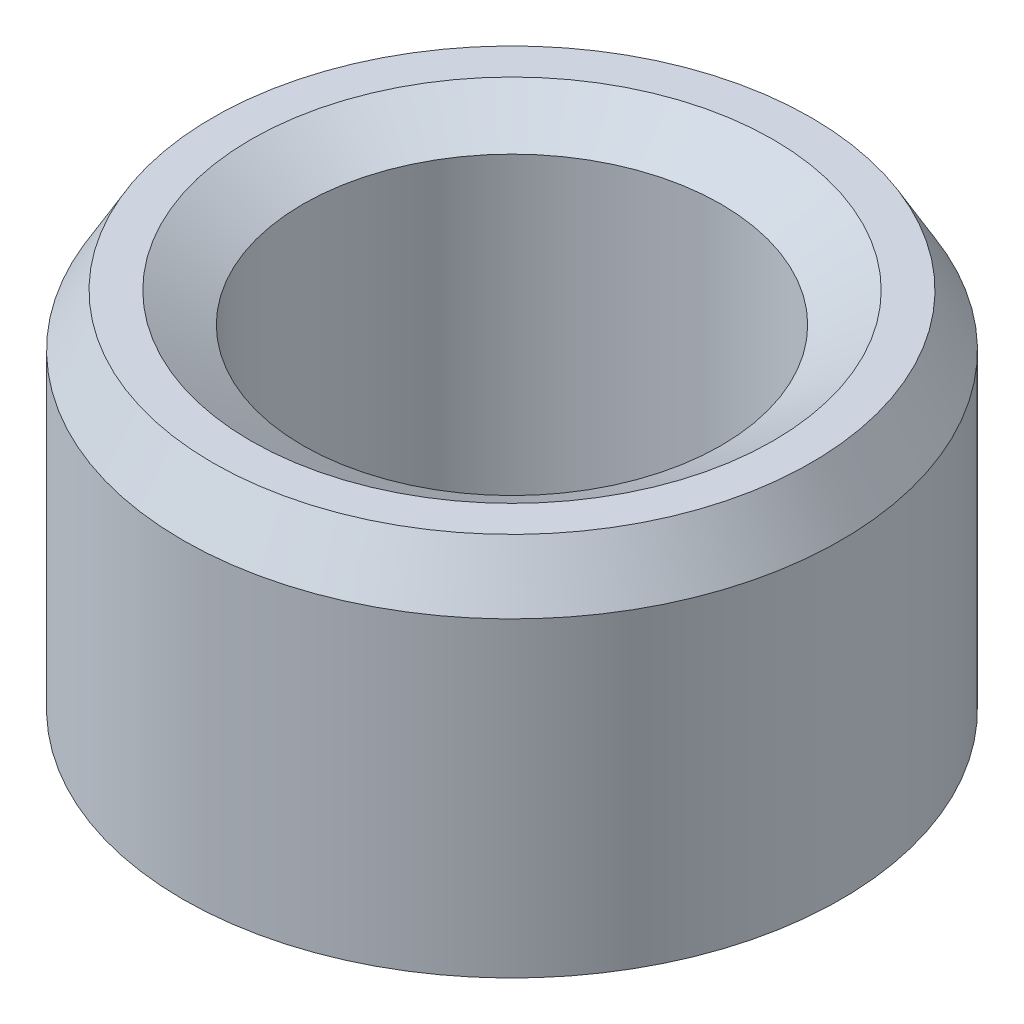
ISO-10303-21;
HEADER;
FILE_DESCRIPTION(('STEP AP214'),'2;1');
FILE_NAME('part.step','',(''),(''),'','','');
FILE_SCHEMA(('AUTOMOTIVE_DESIGN { 1 0 10303 214 1 1 1 1 }'));
ENDSEC;
DATA;
#1=APPLICATION_CONTEXT('core data for automotive mechanical design processes');
#2=APPLICATION_PROTOCOL_DEFINITION('international standard','automotive_design',2000,#1);
#3=PRODUCT_CONTEXT('',#1,'mechanical');
#4=PRODUCT('Part','Part','',(#3));
#5=PRODUCT_RELATED_PRODUCT_CATEGORY('part','',(#4));
#6=PRODUCT_DEFINITION_FORMATION('','',#4);
#7=PRODUCT_DEFINITION_CONTEXT('part definition',#1,'design');
#8=PRODUCT_DEFINITION('design','',#6,#7);
#9=PRODUCT_DEFINITION_SHAPE('','',#8);
#10=(LENGTH_UNIT() NAMED_UNIT(*) SI_UNIT(.MILLI.,.METRE.));
#11=(NAMED_UNIT(*) PLANE_ANGLE_UNIT() SI_UNIT($,.RADIAN.));
#12=(NAMED_UNIT(*) SI_UNIT($,.STERADIAN.) SOLID_ANGLE_UNIT());
#13=UNCERTAINTY_MEASURE_WITH_UNIT(LENGTH_MEASURE(1.E-05),#10,'distance_accuracy_value','');
#14=(GEOMETRIC_REPRESENTATION_CONTEXT(3) GLOBAL_UNCERTAINTY_ASSIGNED_CONTEXT((#13)) GLOBAL_UNIT_ASSIGNED_CONTEXT((#10,
#11,#12)) REPRESENTATION_CONTEXT('',''));
#15=CARTESIAN_POINT('',(0.,0.,0.));
#16=DIRECTION('',(0.,0.,1.));
#17=DIRECTION('',(1.,0.,0.));
#18=AXIS2_PLACEMENT_3D('',#15,#16,#17);
#19=CARTESIAN_POINT('',(0.,20.8946732584259,0.));
#20=DIRECTION('',(0.,-1.,0.));
#21=DIRECTION('',(0.,0.,-1.));
#22=AXIS2_PLACEMENT_3D('',#19,#20,#21);
#23=CYLINDRICAL_SURFACE('',#22,17.5);
#24=CARTESIAN_POINT('',(0.,1.59598908697006,0.));
#25=DIRECTION('',(0.,1.,0.));
#26=DIRECTION('',(0.,0.,1.));
#27=AXIS2_PLACEMENT_3D('',#24,#25,#26);
#28=CIRCLE('',#27,17.5);
#29=CARTESIAN_POINT('',(0.,1.59598908697006,-17.5));
#30=VERTEX_POINT('',#29);
#31=EDGE_CURVE('E10',#30,#30,#28,.T.);
#32=CARTESIAN_POINT('',(0.,18.1303390714683,0.));
#33=DIRECTION('',(0.,1.,0.));
#34=DIRECTION('',(0.,0.,1.));
#35=AXIS2_PLACEMENT_3D('',#32,#33,#34);
#36=CIRCLE('',#35,17.5);
#37=CARTESIAN_POINT('',(0.,18.1303390714683,-17.5));
#38=VERTEX_POINT('',#37);
#39=EDGE_CURVE('E50',#38,#38,#36,.F.);
#40=CARTESIAN_POINT('',(0.,1.59598908697006,-17.5));
#41=CARTESIAN_POINT('',(0.,1.76822189930859,-17.5));
#42=CARTESIAN_POINT('',(0.,1.94045471164711,-17.5));
#43=CARTESIAN_POINT('',(0.,2.28492033632416,-17.5));
#44=CARTESIAN_POINT('',(0.,2.45715314866268,-17.5));
#45=CARTESIAN_POINT('',(0.,2.80161877333973,-17.5));
#46=CARTESIAN_POINT('',(0.,2.97385158567825,-17.5));
#47=CARTESIAN_POINT('',(0.,3.3183172103553,-17.5));
#48=CARTESIAN_POINT('',(0.,3.49055002269382,-17.5));
#49=CARTESIAN_POINT('',(0.,3.83501564737087,-17.5));
#50=CARTESIAN_POINT('',(0.,4.00724845970939,-17.5));
#51=CARTESIAN_POINT('',(0.,4.35171408438644,-17.5));
#52=CARTESIAN_POINT('',(0.,4.52394689672497,-17.5));
#53=CARTESIAN_POINT('',(0.,4.86841252140201,-17.5));
#54=CARTESIAN_POINT('',(0.,5.04064533374054,-17.5));
#55=CARTESIAN_POINT('',(0.,5.38511095841759,-17.5));
#56=CARTESIAN_POINT('',(0.,5.55734377075611,-17.5));
#57=CARTESIAN_POINT('',(0.,5.90180939543315,-17.5));
#58=CARTESIAN_POINT('',(0.,6.07404220777168,-17.5));
#59=CARTESIAN_POINT('',(0.,6.41850783244873,-17.5));
#60=CARTESIAN_POINT('',(0.,6.59074064478725,-17.5));
#61=CARTESIAN_POINT('',(0.,6.9352062694643,-17.5));
#62=CARTESIAN_POINT('',(0.,7.10743908180282,-17.5));
#63=CARTESIAN_POINT('',(0.,7.45190470647987,-17.5));
#64=CARTESIAN_POINT('',(0.,7.62413751881839,-17.5));
#65=CARTESIAN_POINT('',(0.,7.96860314349544,-17.5));
#66=CARTESIAN_POINT('',(0.,8.14083595583396,-17.5));
#67=CARTESIAN_POINT('',(0.,8.48530158051101,-17.5));
#68=CARTESIAN_POINT('',(0.,8.65753439284954,-17.5));
#69=CARTESIAN_POINT('',(0.,9.00200001752658,-17.5));
#70=CARTESIAN_POINT('',(0.,9.17423282986511,-17.5));
#71=CARTESIAN_POINT('',(0.,9.51869845454216,-17.5));
#72=CARTESIAN_POINT('',(0.,9.69093126688068,-17.5));
#73=CARTESIAN_POINT('',(0.,10.0353968915577,-17.5));
#74=CARTESIAN_POINT('',(0.,10.2076297038963,-17.5));
#75=CARTESIAN_POINT('',(0.,10.5520953285733,-17.5));
#76=CARTESIAN_POINT('',(0.,10.7243281409118,-17.5));
#77=CARTESIAN_POINT('',(0.,11.0687937655889,-17.5));
#78=CARTESIAN_POINT('',(0.,11.2410265779274,-17.5));
#79=CARTESIAN_POINT('',(0.,11.5854922026044,-17.5));
#80=CARTESIAN_POINT('',(0.,11.757725014943,-17.5));
#81=CARTESIAN_POINT('',(0.,12.10219063962,-17.5));
#82=CARTESIAN_POINT('',(0.,12.2744234519585,-17.5));
#83=CARTESIAN_POINT('',(0.,12.6188890766356,-17.5));
#84=CARTESIAN_POINT('',(0.,12.7911218889741,-17.5));
#85=CARTESIAN_POINT('',(0.,13.1355875136512,-17.5));
#86=CARTESIAN_POINT('',(0.,13.3078203259897,-17.5));
#87=CARTESIAN_POINT('',(0.,13.6522859506667,-17.5));
#88=CARTESIAN_POINT('',(0.,13.8245187630052,-17.5));
#89=CARTESIAN_POINT('',(0.,14.1689843876823,-17.5));
#90=CARTESIAN_POINT('',(0.,14.3412172000208,-17.5));
#91=CARTESIAN_POINT('',(0.,14.6856828246979,-17.5));
#92=CARTESIAN_POINT('',(0.,14.8579156370364,-17.5));
#93=CARTESIAN_POINT('',(0.,15.2023812617134,-17.5));
#94=CARTESIAN_POINT('',(0.,15.374614074052,-17.5));
#95=CARTESIAN_POINT('',(0.,15.719079698729,-17.5));
#96=CARTESIAN_POINT('',(0.,15.8913125110675,-17.5));
#97=CARTESIAN_POINT('',(0.,16.2357781357446,-17.5));
#98=CARTESIAN_POINT('',(0.,16.4080109480831,-17.5));
#99=CARTESIAN_POINT('',(0.,16.7524765727602,-17.5));
#100=CARTESIAN_POINT('',(0.,16.9247093850987,-17.5));
#101=CARTESIAN_POINT('',(0.,17.2691750097757,-17.5));
#102=CARTESIAN_POINT('',(0.,17.4414078221142,-17.5));
#103=CARTESIAN_POINT('',(0.,17.7858734467913,-17.5));
#104=CARTESIAN_POINT('',(0.,17.9581062591298,-17.5));
#105=CARTESIAN_POINT('',(0.,18.1303390714683,-17.5));
#106=B_SPLINE_CURVE_WITH_KNOTS('',3,(#40,#41,#42,#43,#44,#45,#46,#47,#48,#49,#50,#51,#52,#53,
#54,#55,#56,#57,#58,#59,#60,#61,#62,#63,#64,#65,#66,#67,#68,#69,#70,#71,#72,#73,#74,#75,#76,#77,
#78,#79,#80,#81,#82,#83,#84,#85,#86,#87,#88,#89,#90,#91,#92,#93,#94,#95,#96,#97,#98,#99,#100,
#101,#102,#103,#104,#105),.UNSPECIFIED.,.F.,.F.,(4,2,2,2,2,2,2,2,2,2,2,2,2,2,2,2,2,2,2,2,2,2,2,
2,2,2,2,2,2,2,2,2,4),(0.,0.516698437015572,1.03339687403114,1.55009531104671,2.06679374806229,
2.58349218507786,3.10019062209343,3.616889059109,4.13358749612457,4.65028593314014,
5.16698437015571,5.68368280717128,6.20038124418685,6.71707968120243,7.233778118218,
7.75047655523357,8.26717499224914,8.78387342926471,9.30057186628028,9.81727030329585,
10.3339687403114,10.850667177327,11.3673656143426,11.8840640513581,12.4007624883737,
12.9174609253893,13.4341593624049,13.9508577994204,14.467556236436,14.9842546734516,
15.5009531104671,16.0176515474827,16.5343499844983),.UNSPECIFIED.);
#107=EDGE_CURVE('BSEAM39',#30,#38,#106,.T.);
#108=ORIENTED_EDGE('',*,*,#31,.T.);
#109=ORIENTED_EDGE('',*,*,#39,.T.);
#110=ORIENTED_EDGE('',*,*,#107,.T.);
#111=ORIENTED_EDGE('',*,*,#107,.F.);
#112=EDGE_LOOP('',(#108,#110,#109,#111));
#113=FACE_BOUND('',#112,.T.);
#114=ADVANCED_FACE('F39',(#113),#23,.T.);
#115=CARTESIAN_POINT('',(0.,20.8946732584259,0.));
#116=DIRECTION('',(0.,1.,0.));
#117=DIRECTION('',(0.,0.,1.));
#118=AXIS2_PLACEMENT_3D('',#115,#116,#117);
#119=PLANE('',#118);
#120=CARTESIAN_POINT('',(0.,20.8946732584259,0.));
#121=DIRECTION('',(0.,1.,0.));
#122=DIRECTION('',(0.,0.,1.));
#123=AXIS2_PLACEMENT_3D('',#120,#121,#122);
#124=CIRCLE('',#123,13.8821055287034);
#125=CARTESIAN_POINT('',(0.,20.8946732584259,13.8821055287034));
#126=VERTEX_POINT('',#125);
#127=EDGE_CURVE('E58',#126,#126,#124,.F.);
#128=ORIENTED_EDGE('',*,*,#127,.T.);
#129=EDGE_LOOP('',(#128));
#130=FACE_BOUND('',#129,.T.);
#131=CARTESIAN_POINT('',(0.,20.8946732584259,0.));
#132=DIRECTION('',(0.,1.,0.));
#133=DIRECTION('',(0.,0.,1.));
#134=AXIS2_PLACEMENT_3D('',#131,#132,#133);
#135=CIRCLE('',#134,15.90401091303);
#136=CARTESIAN_POINT('',(0.,20.8946732584259,15.90401091303));
#137=VERTEX_POINT('',#136);
#138=EDGE_CURVE('E61',#137,#137,#135,.T.);
#139=ORIENTED_EDGE('',*,*,#138,.T.);
#140=EDGE_LOOP('',(#139));
#141=FACE_BOUND('',#140,.T.);
#142=ADVANCED_FACE('F88',(#130,#141),#119,.T.);
#143=CARTESIAN_POINT('',(0.,0.,0.));
#144=DIRECTION('',(0.,1.,0.));
#145=DIRECTION('',(0.,0.,1.));
#146=AXIS2_PLACEMENT_3D('',#143,#144,#145);
#147=PLANE('',#146);
#148=CARTESIAN_POINT('',(0.,0.,0.));
#149=DIRECTION('',(0.,1.,0.));
#150=DIRECTION('',(0.,0.,1.));
#151=AXIS2_PLACEMENT_3D('',#148,#149,#150);
#152=CIRCLE('',#151,12.7137604287158);
#153=CARTESIAN_POINT('',(0.,0.,12.7137604287158));
#154=VERTEX_POINT('',#153);
#155=EDGE_CURVE('E51',#154,#154,#152,.T.);
#156=ORIENTED_EDGE('',*,*,#155,.T.);
#157=EDGE_LOOP('',(#156));
#158=FACE_BOUND('',#157,.T.);
#159=CARTESIAN_POINT('',(0.,0.,0.));
#160=DIRECTION('',(0.,1.,0.));
#161=DIRECTION('',(0.,0.,1.));
#162=AXIS2_PLACEMENT_3D('',#159,#160,#161);
#163=CIRCLE('',#162,14.7356658130424);
#164=CARTESIAN_POINT('',(0.,0.,14.7356658130424));
#165=VERTEX_POINT('',#164);
#166=EDGE_CURVE('E54',#165,#165,#163,.F.);
#167=ORIENTED_EDGE('',*,*,#166,.T.);
#168=EDGE_LOOP('',(#167));
#169=FACE_BOUND('',#168,.T.);
#170=ADVANCED_FACE('F83',(#158,#169),#147,.F.);
#171=CARTESIAN_POINT('',(0.,20.8946732584259,0.));
#172=DIRECTION('',(0.,-1.,0.));
#173=DIRECTION('',(0.,0.,-1.));
#174=AXIS2_PLACEMENT_3D('',#171,#172,#173);
#175=CYLINDRICAL_SURFACE('',#174,11.1177713417457);
#176=CARTESIAN_POINT('',(0.,19.2986841714559,0.));
#177=DIRECTION('',(0.,1.,0.));
#178=DIRECTION('',(0.,0.,1.));
#179=AXIS2_PLACEMENT_3D('',#176,#177,#178);
#180=CIRCLE('',#179,11.1177713417457);
#181=CARTESIAN_POINT('',(0.,19.2986841714559,-11.1177713417457));
#182=VERTEX_POINT('',#181);
#183=EDGE_CURVE('E67',#182,#182,#180,.T.);
#184=CARTESIAN_POINT('',(0.,2.76433418695761,0.));
#185=DIRECTION('',(0.,1.,0.));
#186=DIRECTION('',(0.,0.,1.));
#187=AXIS2_PLACEMENT_3D('',#184,#185,#186);
#188=CIRCLE('',#187,11.1177713417457);
#189=CARTESIAN_POINT('',(0.,2.7643341869576,-11.1177713417457));
#190=VERTEX_POINT('',#189);
#191=EDGE_CURVE('E69',#190,#190,#188,.F.);
#192=CARTESIAN_POINT('',(0.,19.2986841714559,-11.1177713417457));
#193=CARTESIAN_POINT('',(0.,19.1264513591173,-11.1177713417457));
#194=CARTESIAN_POINT('',(0.,18.9542185467788,-11.1177713417457));
#195=CARTESIAN_POINT('',(0.,18.6097529221018,-11.1177713417457));
#196=CARTESIAN_POINT('',(0.,18.4375201097633,-11.1177713417457));
#197=CARTESIAN_POINT('',(0.,18.0930544850862,-11.1177713417457));
#198=CARTESIAN_POINT('',(0.,17.9208216727477,-11.1177713417457));
#199=CARTESIAN_POINT('',(0.,17.5763560480706,-11.1177713417457));
#200=CARTESIAN_POINT('',(0.,17.4041232357321,-11.1177713417457));
#201=CARTESIAN_POINT('',(0.,17.0596576110551,-11.1177713417457));
#202=CARTESIAN_POINT('',(0.,16.8874247987165,-11.1177713417457));
#203=CARTESIAN_POINT('',(0.,16.5429591740395,-11.1177713417457));
#204=CARTESIAN_POINT('',(0.,16.370726361701,-11.1177713417457));
#205=CARTESIAN_POINT('',(0.,16.0262607370239,-11.1177713417457));
#206=CARTESIAN_POINT('',(0.,15.8540279246854,-11.1177713417457));
#207=CARTESIAN_POINT('',(0.,15.5095623000083,-11.1177713417457));
#208=CARTESIAN_POINT('',(0.,15.3373294876698,-11.1177713417457));
#209=CARTESIAN_POINT('',(0.,14.9928638629928,-11.1177713417457));
#210=CARTESIAN_POINT('',(0.,14.8206310506543,-11.1177713417457));
#211=CARTESIAN_POINT('',(0.,14.4761654259772,-11.1177713417457));
#212=CARTESIAN_POINT('',(0.,14.3039326136387,-11.1177713417457));
#213=CARTESIAN_POINT('',(0.,13.9594669889616,-11.1177713417457));
#214=CARTESIAN_POINT('',(0.,13.7872341766231,-11.1177713417457));
#215=CARTESIAN_POINT('',(0.,13.4427685519461,-11.1177713417457));
#216=CARTESIAN_POINT('',(0.,13.2705357396075,-11.1177713417457));
#217=CARTESIAN_POINT('',(0.,12.9260701149305,-11.1177713417457));
#218=CARTESIAN_POINT('',(0.,12.753837302592,-11.1177713417457));
#219=CARTESIAN_POINT('',(0.,12.4093716779149,-11.1177713417457));
#220=CARTESIAN_POINT('',(0.,12.2371388655764,-11.1177713417457));
#221=CARTESIAN_POINT('',(0.,11.8926732408994,-11.1177713417457));
#222=CARTESIAN_POINT('',(0.,11.7204404285608,-11.1177713417457));
#223=CARTESIAN_POINT('',(0.,11.3759748038838,-11.1177713417457));
#224=CARTESIAN_POINT('',(0.,11.2037419915453,-11.1177713417457));
#225=CARTESIAN_POINT('',(0.,10.8592763668682,-11.1177713417457));
#226=CARTESIAN_POINT('',(0.,10.6870435545297,-11.1177713417457));
#227=CARTESIAN_POINT('',(0.,10.3425779298526,-11.1177713417457));
#228=CARTESIAN_POINT('',(0.,10.1703451175141,-11.1177713417457));
#229=CARTESIAN_POINT('',(0.,9.82587949283707,-11.1177713417457));
#230=CARTESIAN_POINT('',(0.,9.65364668049855,-11.1177713417457));
#231=CARTESIAN_POINT('',(0.,9.3091810558215,-11.1177713417457));
#232=CARTESIAN_POINT('',(0.,9.13694824348298,-11.1177713417457));
#233=CARTESIAN_POINT('',(0.,8.79248261880593,-11.1177713417457));
#234=CARTESIAN_POINT('',(0.,8.6202498064674,-11.1177713417457));
#235=CARTESIAN_POINT('',(0.,8.27578418179036,-11.1177713417457));
#236=CARTESIAN_POINT('',(0.,8.10355136945183,-11.1177713417457));
#237=CARTESIAN_POINT('',(0.,7.75908574477478,-11.1177713417457));
#238=CARTESIAN_POINT('',(0.,7.58685293243626,-11.1177713417457));
#239=CARTESIAN_POINT('',(0.,7.24238730775921,-11.1177713417457));
#240=CARTESIAN_POINT('',(0.,7.07015449542069,-11.1177713417457));
#241=CARTESIAN_POINT('',(0.,6.72568887074364,-11.1177713417457));
#242=CARTESIAN_POINT('',(0.,6.55345605840512,-11.1177713417457));
#243=CARTESIAN_POINT('',(0.,6.20899043372807,-11.1177713417457));
#244=CARTESIAN_POINT('',(0.,6.03675762138955,-11.1177713417457));
#245=CARTESIAN_POINT('',(0.,5.6922919967125,-11.1177713417457));
#246=CARTESIAN_POINT('',(0.,5.52005918437398,-11.1177713417457));
#247=CARTESIAN_POINT('',(0.,5.17559355969693,-11.1177713417457));
#248=CARTESIAN_POINT('',(0.,5.00336074735841,-11.1177713417457));
#249=CARTESIAN_POINT('',(0.,4.65889512268136,-11.1177713417457));
#250=CARTESIAN_POINT('',(0.,4.48666231034284,-11.1177713417457));
#251=CARTESIAN_POINT('',(0.,4.14219668566579,-11.1177713417457));
#252=CARTESIAN_POINT('',(0.,3.96996387332726,-11.1177713417457));
#253=CARTESIAN_POINT('',(0.,3.62549824865022,-11.1177713417457));
#254=CARTESIAN_POINT('',(0.,3.4532654363117,-11.1177713417457));
#255=CARTESIAN_POINT('',(0.,3.10879981163465,-11.1177713417457));
#256=CARTESIAN_POINT('',(0.,2.93656699929613,-11.1177713417457));
#257=CARTESIAN_POINT('',(0.,2.7643341869576,-11.1177713417457));
#258=B_SPLINE_CURVE_WITH_KNOTS('',3,(#192,#193,#194,#195,#196,#197,#198,#199,#200,#201,#202,
#203,#204,#205,#206,#207,#208,#209,#210,#211,#212,#213,#214,#215,#216,#217,#218,#219,#220,#221,
#222,#223,#224,#225,#226,#227,#228,#229,#230,#231,#232,#233,#234,#235,#236,#237,#238,#239,#240,
#241,#242,#243,#244,#245,#246,#247,#248,#249,#250,#251,#252,#253,#254,#255,#256,#257),
.UNSPECIFIED.,.F.,.F.,(4,2,2,2,2,2,2,2,2,2,2,2,2,2,2,2,2,2,2,2,2,2,2,2,2,2,2,2,2,2,2,2,4),(0.,
0.516698437015572,1.03339687403114,1.55009531104671,2.06679374806229,2.58349218507786,
3.10019062209343,3.616889059109,4.13358749612457,4.65028593314014,5.16698437015571,
5.68368280717128,6.20038124418685,6.71707968120242,7.23377811821799,7.75047655523356,
8.26717499224914,8.78387342926471,9.30057186628028,9.81727030329585,10.3339687403114,
10.850667177327,11.3673656143426,11.8840640513581,12.4007624883737,12.9174609253893,
13.4341593624048,13.9508577994204,14.467556236436,14.9842546734516,15.5009531104671,
16.0176515474827,16.5343499844983),.UNSPECIFIED.);
#259=EDGE_CURVE('BSEAM71',#182,#190,#258,.T.);
#260=ORIENTED_EDGE('',*,*,#183,.T.);
#261=ORIENTED_EDGE('',*,*,#191,.T.);
#262=ORIENTED_EDGE('',*,*,#259,.T.);
#263=ORIENTED_EDGE('',*,*,#259,.F.);
#264=EDGE_LOOP('',(#260,#262,#261,#263));
#265=FACE_BOUND('',#264,.T.);
#266=ADVANCED_FACE('F71',(#265),#175,.F.);
#267=CARTESIAN_POINT('',(0.,19.2986841714559,0.));
#268=DIRECTION('',(0.,1.,0.));
#269=DIRECTION('',(0.,0.,1.));
#270=AXIS2_PLACEMENT_3D('',#267,#268,#269);
#271=CONICAL_SURFACE('',#270,11.1177713417457,1.0471975511966);
#272=ORIENTED_EDGE('',*,*,#127,.F.);
#273=EDGE_LOOP('',(#272));
#274=FACE_BOUND('',#273,.T.);
#275=ORIENTED_EDGE('',*,*,#183,.F.);
#276=EDGE_LOOP('',(#275));
#277=FACE_BOUND('',#276,.T.);
#278=ADVANCED_FACE('F77',(#274,#277),#271,.F.);
#279=CARTESIAN_POINT('',(0.,0.,0.));
#280=DIRECTION('',(0.,-1.,0.));
#281=DIRECTION('',(0.,0.,-1.));
#282=AXIS2_PLACEMENT_3D('',#279,#280,#281);
#283=CONICAL_SURFACE('',#282,12.7137604287158,0.523598775598294);
#284=ORIENTED_EDGE('',*,*,#191,.F.);
#285=EDGE_LOOP('',(#284));
#286=FACE_BOUND('',#285,.T.);
#287=ORIENTED_EDGE('',*,*,#155,.F.);
#288=EDGE_LOOP('',(#287));
#289=FACE_BOUND('',#288,.T.);
#290=ADVANCED_FACE('F73',(#286,#289),#283,.F.);
#291=CARTESIAN_POINT('',(0.,1.59598908697006,0.));
#292=DIRECTION('',(0.,1.,0.));
#293=DIRECTION('',(0.,0.,1.));
#294=AXIS2_PLACEMENT_3D('',#291,#292,#293);
#295=CONICAL_SURFACE('',#294,17.5,1.0471975511966);
#296=ORIENTED_EDGE('',*,*,#166,.F.);
#297=EDGE_LOOP('',(#296));
#298=FACE_BOUND('',#297,.T.);
#299=ORIENTED_EDGE('',*,*,#31,.F.);
#300=EDGE_LOOP('',(#299));
#301=FACE_BOUND('',#300,.T.);
#302=ADVANCED_FACE('F76',(#298,#301),#295,.T.);
#303=CARTESIAN_POINT('',(0.,20.8946732584259,0.));
#304=DIRECTION('',(0.,-1.,0.));
#305=DIRECTION('',(0.,0.,-1.));
#306=AXIS2_PLACEMENT_3D('',#303,#304,#305);
#307=CONICAL_SURFACE('',#306,15.90401091303,0.523598775598296);
#308=ORIENTED_EDGE('',*,*,#39,.F.);
#309=EDGE_LOOP('',(#308));
#310=FACE_BOUND('',#309,.T.);
#311=ORIENTED_EDGE('',*,*,#138,.F.);
#312=EDGE_LOOP('',(#311));
#313=FACE_BOUND('',#312,.T.);
#314=ADVANCED_FACE('F45',(#310,#313),#307,.T.);
#315=CLOSED_SHELL('',(#114,#142,#170,#266,#278,#290,#302,#314));
#316=MANIFOLD_SOLID_BREP('B2',#315);
#317=ADVANCED_BREP_SHAPE_REPRESENTATION('',(#18,#316),#14);
#318=SHAPE_DEFINITION_REPRESENTATION(#9,#317);
ENDSEC;
END-ISO-10303-21;
